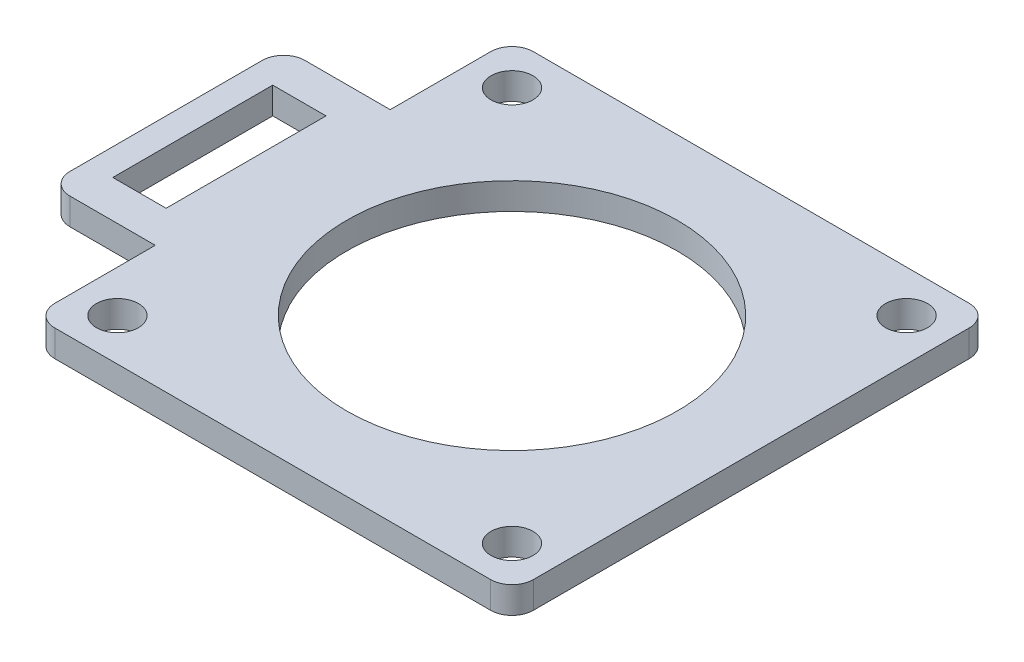
ISO-10303-21;
HEADER;
FILE_DESCRIPTION(('STEP AP214'),'2;1');
FILE_NAME('part.step','',(''),(''),'','','');
FILE_SCHEMA(('AUTOMOTIVE_DESIGN { 1 0 10303 214 1 1 1 1 }'));
ENDSEC;
DATA;
#1=APPLICATION_CONTEXT('core data for automotive mechanical design processes');
#2=APPLICATION_PROTOCOL_DEFINITION('international standard','automotive_design',2000,#1);
#3=PRODUCT_CONTEXT('',#1,'mechanical');
#4=PRODUCT('Part','Part','',(#3));
#5=PRODUCT_RELATED_PRODUCT_CATEGORY('part','',(#4));
#6=PRODUCT_DEFINITION_FORMATION('','',#4);
#7=PRODUCT_DEFINITION_CONTEXT('part definition',#1,'design');
#8=PRODUCT_DEFINITION('design','',#6,#7);
#9=PRODUCT_DEFINITION_SHAPE('','',#8);
#10=(LENGTH_UNIT() NAMED_UNIT(*) SI_UNIT(.MILLI.,.METRE.));
#11=(NAMED_UNIT(*) PLANE_ANGLE_UNIT() SI_UNIT($,.RADIAN.));
#12=(NAMED_UNIT(*) SI_UNIT($,.STERADIAN.) SOLID_ANGLE_UNIT());
#13=UNCERTAINTY_MEASURE_WITH_UNIT(LENGTH_MEASURE(1.E-05),#10,'distance_accuracy_value','');
#14=(GEOMETRIC_REPRESENTATION_CONTEXT(3) GLOBAL_UNCERTAINTY_ASSIGNED_CONTEXT((#13)) GLOBAL_UNIT_ASSIGNED_CONTEXT((#10,
#11,#12)) REPRESENTATION_CONTEXT('',''));
#15=CARTESIAN_POINT('',(0.,0.,0.));
#16=DIRECTION('',(0.,0.,1.));
#17=DIRECTION('',(1.,0.,0.));
#18=AXIS2_PLACEMENT_3D('',#15,#16,#17);
#19=CARTESIAN_POINT('',(25.9599938,3.175,-25.9599938));
#20=DIRECTION('',(0.,1.,0.));
#21=DIRECTION('',(0.,0.,1.));
#22=AXIS2_PLACEMENT_3D('',#19,#20,#21);
#23=PLANE('',#22);
#24=CARTESIAN_POINT('',(23.5000038000013,3.175,23.5000037999987));
#25=DIRECTION('',(0.,1.,0.));
#26=DIRECTION('',(0.,0.,1.));
#27=AXIS2_PLACEMENT_3D('',#24,#25,#26);
#28=CIRCLE('',#27,2.49999500000186);
#29=CARTESIAN_POINT('',(23.5000038000013,3.175,25.9999988000005));
#30=VERTEX_POINT('',#29);
#31=EDGE_CURVE('E620',#30,#30,#28,.T.);
#32=ORIENTED_EDGE('',*,*,#31,.F.);
#33=EDGE_LOOP('',(#32));
#34=FACE_BOUND('',#33,.T.);
#35=DIRECTION('',(1.,0.,0.));
#36=VECTOR('',#35,1.);
#37=CARTESIAN_POINT('',(-38.0249938,3.175,9.525));
#38=LINE('',#37,#36);
#39=CARTESIAN_POINT('',(-38.0249938,3.175,9.525));
#40=VERTEX_POINT('',#39);
#41=CARTESIAN_POINT('',(-31.6749938,3.175,9.525));
#42=VERTEX_POINT('',#41);
#43=EDGE_CURVE('E168',#40,#42,#38,.T.);
#44=ORIENTED_EDGE('',*,*,#43,.F.);
#45=DIRECTION('',(0.,0.,1.));
#46=VECTOR('',#45,1.);
#47=CARTESIAN_POINT('',(-38.0249938,3.175,-9.525));
#48=LINE('',#47,#46);
#49=CARTESIAN_POINT('',(-38.0249938,3.175,-9.525));
#50=VERTEX_POINT('',#49);
#51=EDGE_CURVE('E160',#50,#40,#48,.T.);
#52=ORIENTED_EDGE('',*,*,#51,.F.);
#53=DIRECTION('',(-1.,0.,0.));
#54=VECTOR('',#53,1.);
#55=CARTESIAN_POINT('',(-38.0249938,3.175,-9.525));
#56=LINE('',#55,#54);
#57=CARTESIAN_POINT('',(-31.6749938,3.175,-9.525));
#58=VERTEX_POINT('',#57);
#59=EDGE_CURVE('E183',#58,#50,#56,.T.);
#60=ORIENTED_EDGE('',*,*,#59,.F.);
#61=DIRECTION('',(0.,0.,-1.));
#62=VECTOR('',#61,1.);
#63=CARTESIAN_POINT('',(-31.6749938,3.175,-9.525));
#64=LINE('',#63,#62);
#65=EDGE_CURVE('E181',#42,#58,#64,.T.);
#66=ORIENTED_EDGE('',*,*,#65,.F.);
#67=EDGE_LOOP('',(#44,#52,#60,#66));
#68=FACE_BOUND('',#67,.T.);
#69=CARTESIAN_POINT('',(-23.5000038,3.175,-23.5000038));
#70=DIRECTION('',(0.,1.,0.));
#71=DIRECTION('',(0.,0.,1.));
#72=AXIS2_PLACEMENT_3D('',#69,#70,#71);
#73=CIRCLE('',#72,2.499995);
#74=CARTESIAN_POINT('',(-23.5000038,3.175,-21.0000088));
#75=VERTEX_POINT('',#74);
#76=EDGE_CURVE('E199',#75,#75,#73,.T.);
#77=ORIENTED_EDGE('',*,*,#76,.F.);
#78=EDGE_LOOP('',(#77));
#79=FACE_BOUND('',#78,.T.);
#80=DIRECTION('',(-1.,0.,0.));
#81=VECTOR('',#80,1.);
#82=CARTESIAN_POINT('',(-13.9933145966194,3.175,-28.4999938));
#83=LINE('',#82,#81);
#84=CARTESIAN_POINT('',(25.9599938,3.175,-28.4999938));
#85=VERTEX_POINT('',#84);
#86=CARTESIAN_POINT('',(-25.9599938,3.175,-28.4999938));
#87=VERTEX_POINT('',#86);
#88=EDGE_CURVE('E211',#85,#87,#83,.T.);
#89=ORIENTED_EDGE('',*,*,#88,.T.);
#90=CARTESIAN_POINT('',(-25.9599938,3.175,-25.9599938));
#91=DIRECTION('',(0.,1.,0.));
#92=DIRECTION('',(0.,0.,1.));
#93=AXIS2_PLACEMENT_3D('',#90,#91,#92);
#94=CIRCLE('',#93,2.54);
#95=CARTESIAN_POINT('',(-28.4999938,3.175,-25.9599938));
#96=VERTEX_POINT('',#95);
#97=EDGE_CURVE('E213',#87,#96,#94,.T.);
#98=ORIENTED_EDGE('',*,*,#97,.T.);
#99=DIRECTION('',(0.,0.,1.));
#100=VECTOR('',#99,1.);
#101=CARTESIAN_POINT('',(-28.4999938,3.175,-13.9933145966194));
#102=LINE('',#101,#100);
#103=CARTESIAN_POINT('',(-28.4999938,3.175,-13.9933145966194));
#104=VERTEX_POINT('',#103);
#105=EDGE_CURVE('E216',#96,#104,#102,.T.);
#106=ORIENTED_EDGE('',*,*,#105,.T.);
#107=DIRECTION('',(-1.,0.,0.));
#108=VECTOR('',#107,1.);
#109=CARTESIAN_POINT('',(-28.4999938,3.175,-13.9933145966194));
#110=LINE('',#109,#108);
#111=CARTESIAN_POINT('',(-38.6599938,3.175,-13.9933145966194));
#112=VERTEX_POINT('',#111);
#113=EDGE_CURVE('E218',#104,#112,#110,.T.);
#114=ORIENTED_EDGE('',*,*,#113,.T.);
#115=CARTESIAN_POINT('',(-38.6599938,3.175,-11.4533145966194));
#116=DIRECTION('',(0.,1.,0.));
#117=DIRECTION('',(0.,0.,1.));
#118=AXIS2_PLACEMENT_3D('',#115,#116,#117);
#119=CIRCLE('',#118,2.54);
#120=CARTESIAN_POINT('',(-41.1999938,3.175,-11.4533145966194));
#121=VERTEX_POINT('',#120);
#122=EDGE_CURVE('E220',#112,#121,#119,.T.);
#123=ORIENTED_EDGE('',*,*,#122,.T.);
#124=DIRECTION('',(0.,0.,1.));
#125=VECTOR('',#124,1.);
#126=CARTESIAN_POINT('',(-41.1999938,3.175,-11.4533145966194));
#127=LINE('',#126,#125);
#128=CARTESIAN_POINT('',(-41.1999938,3.175,11.4533145966194));
#129=VERTEX_POINT('',#128);
#130=EDGE_CURVE('E222',#121,#129,#127,.T.);
#131=ORIENTED_EDGE('',*,*,#130,.T.);
#132=CARTESIAN_POINT('',(-38.6599938,3.175,11.4533145966194));
#133=DIRECTION('',(0.,1.,0.));
#134=DIRECTION('',(0.,0.,-1.));
#135=AXIS2_PLACEMENT_3D('',#132,#133,#134);
#136=CIRCLE('',#135,2.54);
#137=CARTESIAN_POINT('',(-38.6599938,3.175,13.9933145966194));
#138=VERTEX_POINT('',#137);
#139=EDGE_CURVE('E224',#129,#138,#136,.T.);
#140=ORIENTED_EDGE('',*,*,#139,.T.);
#141=DIRECTION('',(1.,0.,0.));
#142=VECTOR('',#141,1.);
#143=CARTESIAN_POINT('',(-28.4999938,3.175,13.9933145966194));
#144=LINE('',#143,#142);
#145=CARTESIAN_POINT('',(-28.4999938,3.175,13.9933145966194));
#146=VERTEX_POINT('',#145);
#147=EDGE_CURVE('E226',#138,#146,#144,.T.);
#148=ORIENTED_EDGE('',*,*,#147,.T.);
#149=DIRECTION('',(0.,0.,1.));
#150=VECTOR('',#149,1.);
#151=CARTESIAN_POINT('',(-28.4999938,3.175,25.9599938));
#152=LINE('',#151,#150);
#153=CARTESIAN_POINT('',(-28.4999938,3.175,25.9599938));
#154=VERTEX_POINT('',#153);
#155=EDGE_CURVE('E228',#146,#154,#152,.T.);
#156=ORIENTED_EDGE('',*,*,#155,.T.);
#157=CARTESIAN_POINT('',(-25.9599938,3.175,25.9599938));
#158=DIRECTION('',(0.,1.,0.));
#159=DIRECTION('',(0.,0.,-1.));
#160=AXIS2_PLACEMENT_3D('',#157,#158,#159);
#161=CIRCLE('',#160,2.54);
#162=CARTESIAN_POINT('',(-25.9599938,3.175,28.4999938));
#163=VERTEX_POINT('',#162);
#164=EDGE_CURVE('E230',#154,#163,#161,.T.);
#165=ORIENTED_EDGE('',*,*,#164,.T.);
#166=DIRECTION('',(1.,0.,0.));
#167=VECTOR('',#166,1.);
#168=CARTESIAN_POINT('',(-13.9933145966194,3.175,28.4999938));
#169=LINE('',#168,#167);
#170=CARTESIAN_POINT('',(25.9599938,3.175,28.4999938));
#171=VERTEX_POINT('',#170);
#172=EDGE_CURVE('E232',#163,#171,#169,.T.);
#173=ORIENTED_EDGE('',*,*,#172,.T.);
#174=CARTESIAN_POINT('',(25.9599938,3.175,25.9599938));
#175=DIRECTION('',(0.,1.,0.));
#176=DIRECTION('',(0.,0.,1.));
#177=AXIS2_PLACEMENT_3D('',#174,#175,#176);
#178=CIRCLE('',#177,2.54);
#179=CARTESIAN_POINT('',(28.4999938,3.175,25.9599938));
#180=VERTEX_POINT('',#179);
#181=EDGE_CURVE('E234',#171,#180,#178,.T.);
#182=ORIENTED_EDGE('',*,*,#181,.T.);
#183=DIRECTION('',(0.,0.,-1.));
#184=VECTOR('',#183,1.);
#185=CARTESIAN_POINT('',(28.4999938,3.175,25.9599938));
#186=LINE('',#185,#184);
#187=CARTESIAN_POINT('',(28.4999938,3.175,-25.9599938));
#188=VERTEX_POINT('',#187);
#189=EDGE_CURVE('E236',#180,#188,#186,.T.);
#190=ORIENTED_EDGE('',*,*,#189,.T.);
#191=CARTESIAN_POINT('',(25.9599938,3.175,-25.9599938));
#192=DIRECTION('',(0.,1.,0.));
#193=DIRECTION('',(0.,0.,1.));
#194=AXIS2_PLACEMENT_3D('',#191,#192,#193);
#195=CIRCLE('',#194,2.54);
#196=EDGE_CURVE('E238',#188,#85,#195,.T.);
#197=ORIENTED_EDGE('',*,*,#196,.T.);
#198=EDGE_LOOP('',(#89,#98,#106,#114,#123,#131,#140,#148,#156,#165,#173,#182,#190,#197));
#199=FACE_BOUND('',#198,.T.);
#200=CARTESIAN_POINT('',(0.,3.175,0.));
#201=DIRECTION('',(0.,1.,0.));
#202=DIRECTION('',(0.,0.,1.));
#203=AXIS2_PLACEMENT_3D('',#200,#201,#202);
#204=CIRCLE('',#203,19.685);
#205=CARTESIAN_POINT('',(0.,3.175,19.685));
#206=VERTEX_POINT('',#205);
#207=EDGE_CURVE('E205',#206,#206,#204,.T.);
#208=ORIENTED_EDGE('',*,*,#207,.F.);
#209=EDGE_LOOP('',(#208));
#210=FACE_BOUND('',#209,.T.);
#211=CARTESIAN_POINT('',(23.5000038,3.175,-23.5000038000013));
#212=DIRECTION('',(0.,1.,0.));
#213=DIRECTION('',(0.,0.,1.));
#214=AXIS2_PLACEMENT_3D('',#211,#212,#213);
#215=CIRCLE('',#214,2.49999500000137);
#216=CARTESIAN_POINT('',(23.5000038,3.175,-21.0000088));
#217=VERTEX_POINT('',#216);
#218=EDGE_CURVE('E189',#217,#217,#215,.T.);
#219=ORIENTED_EDGE('',*,*,#218,.F.);
#220=EDGE_LOOP('',(#219));
#221=FACE_BOUND('',#220,.T.);
#222=CARTESIAN_POINT('',(-23.5000037999987,3.175,23.5000038));
#223=DIRECTION('',(0.,1.,0.));
#224=DIRECTION('',(0.,0.,1.));
#225=AXIS2_PLACEMENT_3D('',#222,#223,#224);
#226=CIRCLE('',#225,2.49999500000069);
#227=CARTESIAN_POINT('',(-23.5000037999987,3.175,25.9999988000007));
#228=VERTEX_POINT('',#227);
#229=EDGE_CURVE('E611',#228,#228,#226,.T.);
#230=ORIENTED_EDGE('',*,*,#229,.F.);
#231=EDGE_LOOP('',(#230));
#232=FACE_BOUND('',#231,.T.);
#233=ADVANCED_FACE('F35',(#34,#68,#79,#199,#210,#221,#232),#23,.T.);
#234=CARTESIAN_POINT('',(25.9599938,0.,-25.9599938));
#235=DIRECTION('',(0.,1.,0.));
#236=DIRECTION('',(0.,0.,1.));
#237=AXIS2_PLACEMENT_3D('',#234,#235,#236);
#238=PLANE('',#237);
#239=CARTESIAN_POINT('',(-23.5000038,0.,-23.5000038));
#240=DIRECTION('',(0.,1.,0.));
#241=DIRECTION('',(0.,0.,1.));
#242=AXIS2_PLACEMENT_3D('',#239,#240,#241);
#243=CIRCLE('',#242,2.499995);
#244=CARTESIAN_POINT('',(-23.5000038,0.,-21.0000088));
#245=VERTEX_POINT('',#244);
#246=EDGE_CURVE('E176',#245,#245,#243,.T.);
#247=ORIENTED_EDGE('',*,*,#246,.T.);
#248=EDGE_LOOP('',(#247));
#249=FACE_BOUND('',#248,.T.);
#250=CARTESIAN_POINT('',(0.,0.,0.));
#251=DIRECTION('',(0.,1.,0.));
#252=DIRECTION('',(0.,0.,1.));
#253=AXIS2_PLACEMENT_3D('',#250,#251,#252);
#254=CIRCLE('',#253,19.685);
#255=CARTESIAN_POINT('',(0.,0.,19.685));
#256=VERTEX_POINT('',#255);
#257=EDGE_CURVE('E202',#256,#256,#254,.T.);
#258=ORIENTED_EDGE('',*,*,#257,.T.);
#259=EDGE_LOOP('',(#258));
#260=FACE_BOUND('',#259,.T.);
#261=CARTESIAN_POINT('',(-25.9599938,0.,-25.9599938));
#262=DIRECTION('',(0.,1.,0.));
#263=DIRECTION('',(0.,0.,1.));
#264=AXIS2_PLACEMENT_3D('',#261,#262,#263);
#265=CIRCLE('',#264,2.54);
#266=CARTESIAN_POINT('',(-25.9599938,0.,-28.4999938));
#267=VERTEX_POINT('',#266);
#268=CARTESIAN_POINT('',(-28.4999938,0.,-25.9599938));
#269=VERTEX_POINT('',#268);
#270=EDGE_CURVE('E208',#267,#269,#265,.T.);
#271=ORIENTED_EDGE('',*,*,#270,.F.);
#272=DIRECTION('',(-1.,0.,0.));
#273=VECTOR('',#272,1.);
#274=CARTESIAN_POINT('',(25.9599938,0.,-28.4999938));
#275=LINE('',#274,#273);
#276=CARTESIAN_POINT('',(25.9599938,0.,-28.4999938));
#277=VERTEX_POINT('',#276);
#278=EDGE_CURVE('E214',#277,#267,#275,.T.);
#279=ORIENTED_EDGE('',*,*,#278,.F.);
#280=CARTESIAN_POINT('',(25.9599938,0.,-25.9599938));
#281=DIRECTION('',(0.,1.,0.));
#282=DIRECTION('',(0.,0.,1.));
#283=AXIS2_PLACEMENT_3D('',#280,#281,#282);
#284=CIRCLE('',#283,2.54);
#285=CARTESIAN_POINT('',(28.4999938,0.,-25.9599938));
#286=VERTEX_POINT('',#285);
#287=EDGE_CURVE('E267',#286,#277,#284,.T.);
#288=ORIENTED_EDGE('',*,*,#287,.F.);
#289=DIRECTION('',(0.,0.,-1.));
#290=VECTOR('',#289,1.);
#291=CARTESIAN_POINT('',(28.4999938,0.,-13.9933145966194));
#292=LINE('',#291,#290);
#293=CARTESIAN_POINT('',(28.4999938,0.,25.9599938));
#294=VERTEX_POINT('',#293);
#295=EDGE_CURVE('E265',#294,#286,#292,.T.);
#296=ORIENTED_EDGE('',*,*,#295,.F.);
#297=CARTESIAN_POINT('',(25.9599938,0.,25.9599938));
#298=DIRECTION('',(0.,1.,0.));
#299=DIRECTION('',(0.,0.,1.));
#300=AXIS2_PLACEMENT_3D('',#297,#298,#299);
#301=CIRCLE('',#300,2.54);
#302=CARTESIAN_POINT('',(25.9599938,0.,28.4999938));
#303=VERTEX_POINT('',#302);
#304=EDGE_CURVE('E262',#303,#294,#301,.T.);
#305=ORIENTED_EDGE('',*,*,#304,.F.);
#306=DIRECTION('',(1.,0.,0.));
#307=VECTOR('',#306,1.);
#308=CARTESIAN_POINT('',(25.9599938,0.,28.4999938));
#309=LINE('',#308,#307);
#310=CARTESIAN_POINT('',(-25.9599938,0.,28.4999938));
#311=VERTEX_POINT('',#310);
#312=EDGE_CURVE('E260',#311,#303,#309,.T.);
#313=ORIENTED_EDGE('',*,*,#312,.F.);
#314=CARTESIAN_POINT('',(-25.9599938,0.,25.9599938));
#315=DIRECTION('',(0.,1.,0.));
#316=DIRECTION('',(0.,0.,-1.));
#317=AXIS2_PLACEMENT_3D('',#314,#315,#316);
#318=CIRCLE('',#317,2.54);
#319=CARTESIAN_POINT('',(-28.4999938,0.,25.9599938));
#320=VERTEX_POINT('',#319);
#321=EDGE_CURVE('E257',#320,#311,#318,.T.);
#322=ORIENTED_EDGE('',*,*,#321,.F.);
#323=DIRECTION('',(0.,0.,1.));
#324=VECTOR('',#323,1.);
#325=CARTESIAN_POINT('',(-28.4999938,0.,25.9599938));
#326=LINE('',#325,#324);
#327=CARTESIAN_POINT('',(-28.4999938,0.,13.9933145966194));
#328=VERTEX_POINT('',#327);
#329=EDGE_CURVE('E255',#328,#320,#326,.T.);
#330=ORIENTED_EDGE('',*,*,#329,.F.);
#331=DIRECTION('',(1.,0.,0.));
#332=VECTOR('',#331,1.);
#333=CARTESIAN_POINT('',(-28.4999938,0.,13.9933145966194));
#334=LINE('',#333,#332);
#335=CARTESIAN_POINT('',(-38.6599938,0.,13.9933145966194));
#336=VERTEX_POINT('',#335);
#337=EDGE_CURVE('E253',#336,#328,#334,.T.);
#338=ORIENTED_EDGE('',*,*,#337,.F.);
#339=CARTESIAN_POINT('',(-38.6599938,0.,11.4533145966194));
#340=DIRECTION('',(0.,1.,0.));
#341=DIRECTION('',(0.,0.,-1.));
#342=AXIS2_PLACEMENT_3D('',#339,#340,#341);
#343=CIRCLE('',#342,2.54);
#344=CARTESIAN_POINT('',(-41.1999938,0.,11.4533145966194));
#345=VERTEX_POINT('',#344);
#346=EDGE_CURVE('E251',#345,#336,#343,.T.);
#347=ORIENTED_EDGE('',*,*,#346,.F.);
#348=DIRECTION('',(0.,0.,1.));
#349=VECTOR('',#348,1.);
#350=CARTESIAN_POINT('',(-41.1999938,0.,-11.4533145966194));
#351=LINE('',#350,#349);
#352=CARTESIAN_POINT('',(-41.1999938,0.,-11.4533145966194));
#353=VERTEX_POINT('',#352);
#354=EDGE_CURVE('E249',#353,#345,#351,.T.);
#355=ORIENTED_EDGE('',*,*,#354,.F.);
#356=CARTESIAN_POINT('',(-38.6599938,0.,-11.4533145966194));
#357=DIRECTION('',(0.,1.,0.));
#358=DIRECTION('',(0.,0.,1.));
#359=AXIS2_PLACEMENT_3D('',#356,#357,#358);
#360=CIRCLE('',#359,2.54);
#361=CARTESIAN_POINT('',(-38.6599938,0.,-13.9933145966194));
#362=VERTEX_POINT('',#361);
#363=EDGE_CURVE('E247',#362,#353,#360,.T.);
#364=ORIENTED_EDGE('',*,*,#363,.F.);
#365=DIRECTION('',(-1.,0.,0.));
#366=VECTOR('',#365,1.);
#367=CARTESIAN_POINT('',(-28.4999938,0.,-13.9933145966194));
#368=LINE('',#367,#366);
#369=CARTESIAN_POINT('',(-28.4999938,0.,-13.9933145966194));
#370=VERTEX_POINT('',#369);
#371=EDGE_CURVE('E245',#370,#362,#368,.T.);
#372=ORIENTED_EDGE('',*,*,#371,.F.);
#373=DIRECTION('',(0.,0.,1.));
#374=VECTOR('',#373,1.);
#375=CARTESIAN_POINT('',(-28.4999938,0.,-13.9933145966194));
#376=LINE('',#375,#374);
#377=EDGE_CURVE('E243',#269,#370,#376,.T.);
#378=ORIENTED_EDGE('',*,*,#377,.F.);
#379=EDGE_LOOP('',(#271,#279,#288,#296,#305,#313,#322,#330,#338,#347,#355,#364,#372,#378));
#380=FACE_BOUND('',#379,.T.);
#381=DIRECTION('',(0.,0.,1.));
#382=VECTOR('',#381,1.);
#383=CARTESIAN_POINT('',(-38.0249938,0.,-9.525));
#384=LINE('',#383,#382);
#385=CARTESIAN_POINT('',(-38.0249938,0.,-9.525));
#386=VERTEX_POINT('',#385);
#387=CARTESIAN_POINT('',(-38.0249938,0.,9.525));
#388=VERTEX_POINT('',#387);
#389=EDGE_CURVE('E58',#386,#388,#384,.T.);
#390=ORIENTED_EDGE('',*,*,#389,.T.);
#391=DIRECTION('',(1.,0.,0.));
#392=VECTOR('',#391,1.);
#393=CARTESIAN_POINT('',(-38.0249938,0.,9.525));
#394=LINE('',#393,#392);
#395=CARTESIAN_POINT('',(-31.6749938,0.,9.525));
#396=VERTEX_POINT('',#395);
#397=EDGE_CURVE('E175',#388,#396,#394,.T.);
#398=ORIENTED_EDGE('',*,*,#397,.T.);
#399=DIRECTION('',(0.,0.,-1.));
#400=VECTOR('',#399,1.);
#401=CARTESIAN_POINT('',(-31.6749938,0.,-9.525));
#402=LINE('',#401,#400);
#403=CARTESIAN_POINT('',(-31.6749938,0.,-9.525));
#404=VERTEX_POINT('',#403);
#405=EDGE_CURVE('E191',#396,#404,#402,.T.);
#406=ORIENTED_EDGE('',*,*,#405,.T.);
#407=DIRECTION('',(-1.,0.,0.));
#408=VECTOR('',#407,1.);
#409=CARTESIAN_POINT('',(-38.0249938,0.,-9.525));
#410=LINE('',#409,#408);
#411=EDGE_CURVE('E169',#404,#386,#410,.T.);
#412=ORIENTED_EDGE('',*,*,#411,.T.);
#413=EDGE_LOOP('',(#390,#398,#406,#412));
#414=FACE_BOUND('',#413,.T.);
#415=CARTESIAN_POINT('',(23.5000038,0.,-23.5000038000013));
#416=DIRECTION('',(0.,1.,0.));
#417=DIRECTION('',(0.,0.,1.));
#418=AXIS2_PLACEMENT_3D('',#415,#416,#417);
#419=CIRCLE('',#418,2.49999500000137);
#420=CARTESIAN_POINT('',(23.5000038,0.,-21.0000088));
#421=VERTEX_POINT('',#420);
#422=EDGE_CURVE('E623',#421,#421,#419,.T.);
#423=ORIENTED_EDGE('',*,*,#422,.T.);
#424=EDGE_LOOP('',(#423));
#425=FACE_BOUND('',#424,.T.);
#426=CARTESIAN_POINT('',(23.5000038000013,0.,23.5000037999987));
#427=DIRECTION('',(0.,1.,0.));
#428=DIRECTION('',(0.,0.,1.));
#429=AXIS2_PLACEMENT_3D('',#426,#427,#428);
#430=CIRCLE('',#429,2.49999500000186);
#431=CARTESIAN_POINT('',(23.5000038000013,0.,25.9999988000005));
#432=VERTEX_POINT('',#431);
#433=EDGE_CURVE('E617',#432,#432,#430,.T.);
#434=ORIENTED_EDGE('',*,*,#433,.T.);
#435=EDGE_LOOP('',(#434));
#436=FACE_BOUND('',#435,.T.);
#437=CARTESIAN_POINT('',(-23.5000037999987,0.,23.5000038));
#438=DIRECTION('',(0.,1.,0.));
#439=DIRECTION('',(0.,0.,1.));
#440=AXIS2_PLACEMENT_3D('',#437,#438,#439);
#441=CIRCLE('',#440,2.49999500000069);
#442=CARTESIAN_POINT('',(-23.5000037999987,0.,25.9999988000007));
#443=VERTEX_POINT('',#442);
#444=EDGE_CURVE('E614',#443,#443,#441,.T.);
#445=ORIENTED_EDGE('',*,*,#444,.T.);
#446=EDGE_LOOP('',(#445));
#447=FACE_BOUND('',#446,.T.);
#448=ADVANCED_FACE('F316',(#249,#260,#380,#414,#425,#436,#447),#238,.F.);
#449=CARTESIAN_POINT('',(-25.9599938,3.175,-25.9599938));
#450=DIRECTION('',(0.,-1.,0.));
#451=DIRECTION('',(0.,0.,-1.));
#452=AXIS2_PLACEMENT_3D('',#449,#450,#451);
#453=CYLINDRICAL_SURFACE('',#452,2.54);
#454=ORIENTED_EDGE('',*,*,#270,.T.);
#455=DIRECTION('',(0.,-1.,0.));
#456=VECTOR('',#455,1.);
#457=CARTESIAN_POINT('',(-28.4999938,3.175,-25.9599938));
#458=LINE('',#457,#456);
#459=EDGE_CURVE('E43',#96,#269,#458,.T.);
#460=ORIENTED_EDGE('',*,*,#459,.F.);
#461=ORIENTED_EDGE('',*,*,#97,.F.);
#462=DIRECTION('',(0.,-1.,0.));
#463=VECTOR('',#462,1.);
#464=CARTESIAN_POINT('',(-25.9599938,3.175,-28.4999938));
#465=LINE('',#464,#463);
#466=EDGE_CURVE('E11',#87,#267,#465,.T.);
#467=ORIENTED_EDGE('',*,*,#466,.T.);
#468=EDGE_LOOP('',(#454,#460,#461,#467));
#469=FACE_BOUND('',#468,.T.);
#470=ADVANCED_FACE('F37',(#469),#453,.T.);
#471=CARTESIAN_POINT('',(-28.4999938,3.175,-13.9933145966194));
#472=DIRECTION('',(1.,0.,0.));
#473=DIRECTION('',(0.,0.,-1.));
#474=AXIS2_PLACEMENT_3D('',#471,#472,#473);
#475=PLANE('',#474);
#476=ORIENTED_EDGE('',*,*,#377,.T.);
#477=DIRECTION('',(0.,-1.,0.));
#478=VECTOR('',#477,1.);
#479=CARTESIAN_POINT('',(-28.4999938,3.175,-13.9933145966194));
#480=LINE('',#479,#478);
#481=EDGE_CURVE('E302',#104,#370,#480,.T.);
#482=ORIENTED_EDGE('',*,*,#481,.F.);
#483=ORIENTED_EDGE('',*,*,#105,.F.);
#484=ORIENTED_EDGE('',*,*,#459,.T.);
#485=EDGE_LOOP('',(#476,#482,#483,#484));
#486=FACE_BOUND('',#485,.T.);
#487=ADVANCED_FACE('F309',(#486),#475,.F.);
#488=CARTESIAN_POINT('',(-28.4999938,3.175,-13.9933145966194));
#489=DIRECTION('',(0.,0.,1.));
#490=DIRECTION('',(1.,0.,0.));
#491=AXIS2_PLACEMENT_3D('',#488,#489,#490);
#492=PLANE('',#491);
#493=ORIENTED_EDGE('',*,*,#371,.T.);
#494=DIRECTION('',(0.,-1.,0.));
#495=VECTOR('',#494,1.);
#496=CARTESIAN_POINT('',(-38.6599938,3.175,-13.9933145966194));
#497=LINE('',#496,#495);
#498=EDGE_CURVE('E299',#112,#362,#497,.T.);
#499=ORIENTED_EDGE('',*,*,#498,.F.);
#500=ORIENTED_EDGE('',*,*,#113,.F.);
#501=ORIENTED_EDGE('',*,*,#481,.T.);
#502=EDGE_LOOP('',(#493,#499,#500,#501));
#503=FACE_BOUND('',#502,.T.);
#504=ADVANCED_FACE('F323',(#503),#492,.F.);
#505=CARTESIAN_POINT('',(-38.6599938,3.175,-11.4533145966194));
#506=DIRECTION('',(0.,-1.,0.));
#507=DIRECTION('',(0.,0.,-1.));
#508=AXIS2_PLACEMENT_3D('',#505,#506,#507);
#509=CYLINDRICAL_SURFACE('',#508,2.54);
#510=ORIENTED_EDGE('',*,*,#363,.T.);
#511=DIRECTION('',(0.,-1.,0.));
#512=VECTOR('',#511,1.);
#513=CARTESIAN_POINT('',(-41.1999938,3.175,-11.4533145966194));
#514=LINE('',#513,#512);
#515=EDGE_CURVE('E296',#121,#353,#514,.T.);
#516=ORIENTED_EDGE('',*,*,#515,.F.);
#517=ORIENTED_EDGE('',*,*,#122,.F.);
#518=ORIENTED_EDGE('',*,*,#498,.T.);
#519=EDGE_LOOP('',(#510,#516,#517,#518));
#520=FACE_BOUND('',#519,.T.);
#521=ADVANCED_FACE('F327',(#520),#509,.T.);
#522=CARTESIAN_POINT('',(-41.1999938,3.175,-11.4533145966194));
#523=DIRECTION('',(1.,0.,0.));
#524=DIRECTION('',(0.,0.,-1.));
#525=AXIS2_PLACEMENT_3D('',#522,#523,#524);
#526=PLANE('',#525);
#527=ORIENTED_EDGE('',*,*,#354,.T.);
#528=DIRECTION('',(0.,-1.,0.));
#529=VECTOR('',#528,1.);
#530=CARTESIAN_POINT('',(-41.1999938,3.175,11.4533145966194));
#531=LINE('',#530,#529);
#532=EDGE_CURVE('E293',#129,#345,#531,.T.);
#533=ORIENTED_EDGE('',*,*,#532,.F.);
#534=ORIENTED_EDGE('',*,*,#130,.F.);
#535=ORIENTED_EDGE('',*,*,#515,.T.);
#536=EDGE_LOOP('',(#527,#533,#534,#535));
#537=FACE_BOUND('',#536,.T.);
#538=ADVANCED_FACE('F375',(#537),#526,.F.);
#539=CARTESIAN_POINT('',(-38.6599938,3.175,11.4533145966194));
#540=DIRECTION('',(0.,-1.,0.));
#541=DIRECTION('',(0.,0.,-1.));
#542=AXIS2_PLACEMENT_3D('',#539,#540,#541);
#543=CYLINDRICAL_SURFACE('',#542,2.54);
#544=ORIENTED_EDGE('',*,*,#346,.T.);
#545=DIRECTION('',(0.,-1.,0.));
#546=VECTOR('',#545,1.);
#547=CARTESIAN_POINT('',(-38.6599938,3.175,13.9933145966194));
#548=LINE('',#547,#546);
#549=EDGE_CURVE('E290',#138,#336,#548,.T.);
#550=ORIENTED_EDGE('',*,*,#549,.F.);
#551=ORIENTED_EDGE('',*,*,#139,.F.);
#552=ORIENTED_EDGE('',*,*,#532,.T.);
#553=EDGE_LOOP('',(#544,#550,#551,#552));
#554=FACE_BOUND('',#553,.T.);
#555=ADVANCED_FACE('F373',(#554),#543,.T.);
#556=CARTESIAN_POINT('',(-28.4999938,3.175,13.9933145966194));
#557=DIRECTION('',(0.,0.,-1.));
#558=DIRECTION('',(-1.,0.,0.));
#559=AXIS2_PLACEMENT_3D('',#556,#557,#558);
#560=PLANE('',#559);
#561=ORIENTED_EDGE('',*,*,#337,.T.);
#562=DIRECTION('',(0.,-1.,0.));
#563=VECTOR('',#562,1.);
#564=CARTESIAN_POINT('',(-28.4999938,3.175,13.9933145966194));
#565=LINE('',#564,#563);
#566=EDGE_CURVE('E287',#146,#328,#565,.T.);
#567=ORIENTED_EDGE('',*,*,#566,.F.);
#568=ORIENTED_EDGE('',*,*,#147,.F.);
#569=ORIENTED_EDGE('',*,*,#549,.T.);
#570=EDGE_LOOP('',(#561,#567,#568,#569));
#571=FACE_BOUND('',#570,.T.);
#572=ADVANCED_FACE('F369',(#571),#560,.F.);
#573=CARTESIAN_POINT('',(-28.4999938,3.175,25.9599938));
#574=DIRECTION('',(1.,0.,0.));
#575=DIRECTION('',(0.,0.,-1.));
#576=AXIS2_PLACEMENT_3D('',#573,#574,#575);
#577=PLANE('',#576);
#578=ORIENTED_EDGE('',*,*,#329,.T.);
#579=DIRECTION('',(0.,-1.,0.));
#580=VECTOR('',#579,1.);
#581=CARTESIAN_POINT('',(-28.4999938,3.175,25.9599938));
#582=LINE('',#581,#580);
#583=EDGE_CURVE('E284',#154,#320,#582,.T.);
#584=ORIENTED_EDGE('',*,*,#583,.F.);
#585=ORIENTED_EDGE('',*,*,#155,.F.);
#586=ORIENTED_EDGE('',*,*,#566,.T.);
#587=EDGE_LOOP('',(#578,#584,#585,#586));
#588=FACE_BOUND('',#587,.T.);
#589=ADVANCED_FACE('F365',(#588),#577,.F.);
#590=CARTESIAN_POINT('',(-25.9599938,3.175,25.9599938));
#591=DIRECTION('',(0.,-1.,0.));
#592=DIRECTION('',(0.,0.,-1.));
#593=AXIS2_PLACEMENT_3D('',#590,#591,#592);
#594=CYLINDRICAL_SURFACE('',#593,2.54);
#595=ORIENTED_EDGE('',*,*,#321,.T.);
#596=DIRECTION('',(0.,-1.,0.));
#597=VECTOR('',#596,1.);
#598=CARTESIAN_POINT('',(-25.9599938,3.175,28.4999938));
#599=LINE('',#598,#597);
#600=EDGE_CURVE('E281',#163,#311,#599,.T.);
#601=ORIENTED_EDGE('',*,*,#600,.F.);
#602=ORIENTED_EDGE('',*,*,#164,.F.);
#603=ORIENTED_EDGE('',*,*,#583,.T.);
#604=EDGE_LOOP('',(#595,#601,#602,#603));
#605=FACE_BOUND('',#604,.T.);
#606=ADVANCED_FACE('F356',(#605),#594,.T.);
#607=CARTESIAN_POINT('',(25.9599938,3.175,28.4999938));
#608=DIRECTION('',(0.,0.,-1.));
#609=DIRECTION('',(-1.,0.,0.));
#610=AXIS2_PLACEMENT_3D('',#607,#608,#609);
#611=PLANE('',#610);
#612=ORIENTED_EDGE('',*,*,#312,.T.);
#613=DIRECTION('',(0.,-1.,0.));
#614=VECTOR('',#613,1.);
#615=CARTESIAN_POINT('',(25.9599938,3.175,28.4999938));
#616=LINE('',#615,#614);
#617=EDGE_CURVE('E278',#171,#303,#616,.T.);
#618=ORIENTED_EDGE('',*,*,#617,.F.);
#619=ORIENTED_EDGE('',*,*,#172,.F.);
#620=ORIENTED_EDGE('',*,*,#600,.T.);
#621=EDGE_LOOP('',(#612,#618,#619,#620));
#622=FACE_BOUND('',#621,.T.);
#623=ADVANCED_FACE('F360',(#622),#611,.F.);
#624=CARTESIAN_POINT('',(25.9599938,3.175,25.9599938));
#625=DIRECTION('',(0.,-1.,0.));
#626=DIRECTION('',(0.,0.,-1.));
#627=AXIS2_PLACEMENT_3D('',#624,#625,#626);
#628=CYLINDRICAL_SURFACE('',#627,2.54);
#629=ORIENTED_EDGE('',*,*,#304,.T.);
#630=DIRECTION('',(0.,-1.,0.));
#631=VECTOR('',#630,1.);
#632=CARTESIAN_POINT('',(28.4999938,3.175,25.9599938));
#633=LINE('',#632,#631);
#634=EDGE_CURVE('E275',#180,#294,#633,.T.);
#635=ORIENTED_EDGE('',*,*,#634,.F.);
#636=ORIENTED_EDGE('',*,*,#181,.F.);
#637=ORIENTED_EDGE('',*,*,#617,.T.);
#638=EDGE_LOOP('',(#629,#635,#636,#637));
#639=FACE_BOUND('',#638,.T.);
#640=ADVANCED_FACE('F349',(#639),#628,.T.);
#641=CARTESIAN_POINT('',(28.4999938,3.175,-13.9933145966194));
#642=DIRECTION('',(-1.,0.,0.));
#643=DIRECTION('',(0.,0.,1.));
#644=AXIS2_PLACEMENT_3D('',#641,#642,#643);
#645=PLANE('',#644);
#646=ORIENTED_EDGE('',*,*,#295,.T.);
#647=DIRECTION('',(0.,-1.,0.));
#648=VECTOR('',#647,1.);
#649=CARTESIAN_POINT('',(28.4999938,3.175,-25.9599938));
#650=LINE('',#649,#648);
#651=EDGE_CURVE('E272',#188,#286,#650,.T.);
#652=ORIENTED_EDGE('',*,*,#651,.F.);
#653=ORIENTED_EDGE('',*,*,#189,.F.);
#654=ORIENTED_EDGE('',*,*,#634,.T.);
#655=EDGE_LOOP('',(#646,#652,#653,#654));
#656=FACE_BOUND('',#655,.T.);
#657=ADVANCED_FACE('F345',(#656),#645,.F.);
#658=CARTESIAN_POINT('',(25.9599938,3.175,-25.9599938));
#659=DIRECTION('',(0.,-1.,0.));
#660=DIRECTION('',(0.,0.,-1.));
#661=AXIS2_PLACEMENT_3D('',#658,#659,#660);
#662=CYLINDRICAL_SURFACE('',#661,2.54);
#663=ORIENTED_EDGE('',*,*,#287,.T.);
#664=DIRECTION('',(0.,-1.,0.));
#665=VECTOR('',#664,1.);
#666=CARTESIAN_POINT('',(25.9599938,3.175,-28.4999938));
#667=LINE('',#666,#665);
#668=EDGE_CURVE('E241',#85,#277,#667,.T.);
#669=ORIENTED_EDGE('',*,*,#668,.F.);
#670=ORIENTED_EDGE('',*,*,#196,.F.);
#671=ORIENTED_EDGE('',*,*,#651,.T.);
#672=EDGE_LOOP('',(#663,#669,#670,#671));
#673=FACE_BOUND('',#672,.T.);
#674=ADVANCED_FACE('F340',(#673),#662,.T.);
#675=CARTESIAN_POINT('',(25.9599938,3.175,-28.4999938));
#676=DIRECTION('',(0.,0.,1.));
#677=DIRECTION('',(1.,0.,0.));
#678=AXIS2_PLACEMENT_3D('',#675,#676,#677);
#679=PLANE('',#678);
#680=ORIENTED_EDGE('',*,*,#278,.T.);
#681=ORIENTED_EDGE('',*,*,#466,.F.);
#682=ORIENTED_EDGE('',*,*,#88,.F.);
#683=ORIENTED_EDGE('',*,*,#668,.T.);
#684=EDGE_LOOP('',(#680,#681,#682,#683));
#685=FACE_BOUND('',#684,.T.);
#686=ADVANCED_FACE('F335',(#685),#679,.F.);
#687=CARTESIAN_POINT('',(0.,3.175,0.));
#688=DIRECTION('',(0.,-1.,0.));
#689=DIRECTION('',(0.,0.,-1.));
#690=AXIS2_PLACEMENT_3D('',#687,#688,#689);
#691=CYLINDRICAL_SURFACE('',#690,19.685);
#692=ORIENTED_EDGE('',*,*,#207,.T.);
#693=EDGE_LOOP('',(#692));
#694=FACE_BOUND('',#693,.T.);
#695=ORIENTED_EDGE('',*,*,#257,.F.);
#696=EDGE_LOOP('',(#695));
#697=FACE_BOUND('',#696,.T.);
#698=ADVANCED_FACE('F394',(#694,#697),#691,.F.);
#699=CARTESIAN_POINT('',(-23.5000038,3.175,-23.5000038));
#700=DIRECTION('',(0.,-1.,0.));
#701=DIRECTION('',(0.,0.,-1.));
#702=AXIS2_PLACEMENT_3D('',#699,#700,#701);
#703=CYLINDRICAL_SURFACE('',#702,2.499995);
#704=ORIENTED_EDGE('',*,*,#76,.T.);
#705=EDGE_LOOP('',(#704));
#706=FACE_BOUND('',#705,.T.);
#707=ORIENTED_EDGE('',*,*,#246,.F.);
#708=EDGE_LOOP('',(#707));
#709=FACE_BOUND('',#708,.T.);
#710=ADVANCED_FACE('F450',(#706,#709),#703,.F.);
#711=CARTESIAN_POINT('',(-38.0249938,3.175,-9.525));
#712=DIRECTION('',(1.,0.,0.));
#713=DIRECTION('',(0.,0.,-1.));
#714=AXIS2_PLACEMENT_3D('',#711,#712,#713);
#715=PLANE('',#714);
#716=ORIENTED_EDGE('',*,*,#389,.F.);
#717=DIRECTION('',(0.,-1.,0.));
#718=VECTOR('',#717,1.);
#719=CARTESIAN_POINT('',(-38.0249938,3.175,-9.525));
#720=LINE('',#719,#718);
#721=EDGE_CURVE('E164',#50,#386,#720,.T.);
#722=ORIENTED_EDGE('',*,*,#721,.F.);
#723=ORIENTED_EDGE('',*,*,#51,.T.);
#724=DIRECTION('',(0.,-1.,0.));
#725=VECTOR('',#724,1.);
#726=CARTESIAN_POINT('',(-38.0249938,3.175,9.525));
#727=LINE('',#726,#725);
#728=EDGE_CURVE('E163',#40,#388,#727,.T.);
#729=ORIENTED_EDGE('',*,*,#728,.T.);
#730=EDGE_LOOP('',(#716,#722,#723,#729));
#731=FACE_BOUND('',#730,.T.);
#732=ADVANCED_FACE('F162',(#731),#715,.T.);
#733=CARTESIAN_POINT('',(-38.0249938,3.175,9.525));
#734=DIRECTION('',(0.,0.,-1.));
#735=DIRECTION('',(-1.,0.,0.));
#736=AXIS2_PLACEMENT_3D('',#733,#734,#735);
#737=PLANE('',#736);
#738=ORIENTED_EDGE('',*,*,#397,.F.);
#739=ORIENTED_EDGE('',*,*,#728,.F.);
#740=ORIENTED_EDGE('',*,*,#43,.T.);
#741=DIRECTION('',(0.,-1.,0.));
#742=VECTOR('',#741,1.);
#743=CARTESIAN_POINT('',(-31.6749938,3.175,9.525));
#744=LINE('',#743,#742);
#745=EDGE_CURVE('E177',#42,#396,#744,.T.);
#746=ORIENTED_EDGE('',*,*,#745,.T.);
#747=EDGE_LOOP('',(#738,#739,#740,#746));
#748=FACE_BOUND('',#747,.T.);
#749=ADVANCED_FACE('F172',(#748),#737,.T.);
#750=CARTESIAN_POINT('',(-31.6749938,3.175,-9.525));
#751=DIRECTION('',(-1.,0.,0.));
#752=DIRECTION('',(0.,0.,1.));
#753=AXIS2_PLACEMENT_3D('',#750,#751,#752);
#754=PLANE('',#753);
#755=ORIENTED_EDGE('',*,*,#405,.F.);
#756=ORIENTED_EDGE('',*,*,#745,.F.);
#757=ORIENTED_EDGE('',*,*,#65,.T.);
#758=DIRECTION('',(0.,-1.,0.));
#759=VECTOR('',#758,1.);
#760=CARTESIAN_POINT('',(-31.6749938,3.175,-9.525));
#761=LINE('',#760,#759);
#762=EDGE_CURVE('E50',#58,#404,#761,.T.);
#763=ORIENTED_EDGE('',*,*,#762,.T.);
#764=EDGE_LOOP('',(#755,#756,#757,#763));
#765=FACE_BOUND('',#764,.T.);
#766=ADVANCED_FACE('F469',(#765),#754,.T.);
#767=CARTESIAN_POINT('',(-38.0249938,3.175,-9.525));
#768=DIRECTION('',(0.,0.,1.));
#769=DIRECTION('',(1.,0.,0.));
#770=AXIS2_PLACEMENT_3D('',#767,#768,#769);
#771=PLANE('',#770);
#772=ORIENTED_EDGE('',*,*,#411,.F.);
#773=ORIENTED_EDGE('',*,*,#762,.F.);
#774=ORIENTED_EDGE('',*,*,#59,.T.);
#775=ORIENTED_EDGE('',*,*,#721,.T.);
#776=EDGE_LOOP('',(#772,#773,#774,#775));
#777=FACE_BOUND('',#776,.T.);
#778=ADVANCED_FACE('F476',(#777),#771,.T.);
#779=CARTESIAN_POINT('',(23.5000038,3.175,-23.5000038000013));
#780=DIRECTION('',(0.,-1.,0.));
#781=DIRECTION('',(0.,0.,-1.));
#782=AXIS2_PLACEMENT_3D('',#779,#780,#781);
#783=CYLINDRICAL_SURFACE('',#782,2.49999500000137);
#784=ORIENTED_EDGE('',*,*,#218,.T.);
#785=EDGE_LOOP('',(#784));
#786=FACE_BOUND('',#785,.T.);
#787=ORIENTED_EDGE('',*,*,#422,.F.);
#788=EDGE_LOOP('',(#787));
#789=FACE_BOUND('',#788,.T.);
#790=ADVANCED_FACE('F484',(#786,#789),#783,.F.);
#791=CARTESIAN_POINT('',(23.5000038000013,3.175,23.5000037999987));
#792=DIRECTION('',(0.,-1.,0.));
#793=DIRECTION('',(0.,0.,-1.));
#794=AXIS2_PLACEMENT_3D('',#791,#792,#793);
#795=CYLINDRICAL_SURFACE('',#794,2.49999500000186);
#796=ORIENTED_EDGE('',*,*,#31,.T.);
#797=EDGE_LOOP('',(#796));
#798=FACE_BOUND('',#797,.T.);
#799=ORIENTED_EDGE('',*,*,#433,.F.);
#800=EDGE_LOOP('',(#799));
#801=FACE_BOUND('',#800,.T.);
#802=ADVANCED_FACE('F491',(#798,#801),#795,.F.);
#803=CARTESIAN_POINT('',(-23.5000037999987,3.175,23.5000038));
#804=DIRECTION('',(0.,-1.,0.));
#805=DIRECTION('',(0.,0.,-1.));
#806=AXIS2_PLACEMENT_3D('',#803,#804,#805);
#807=CYLINDRICAL_SURFACE('',#806,2.49999500000069);
#808=ORIENTED_EDGE('',*,*,#229,.T.);
#809=EDGE_LOOP('',(#808));
#810=FACE_BOUND('',#809,.T.);
#811=ORIENTED_EDGE('',*,*,#444,.F.);
#812=EDGE_LOOP('',(#811));
#813=FACE_BOUND('',#812,.T.);
#814=ADVANCED_FACE('F499',(#810,#813),#807,.F.);
#815=CLOSED_SHELL('',(#233,#448,#470,#487,#504,#521,#538,#555,#572,#589,#606,#623,#640,#657,
#674,#686,#698,#710,#732,#749,#766,#778,#790,#802,#814));
#816=MANIFOLD_SOLID_BREP('B2',#815);
#817=ADVANCED_BREP_SHAPE_REPRESENTATION('',(#18,#816),#14);
#818=SHAPE_DEFINITION_REPRESENTATION(#9,#817);
ENDSEC;
END-ISO-10303-21;
